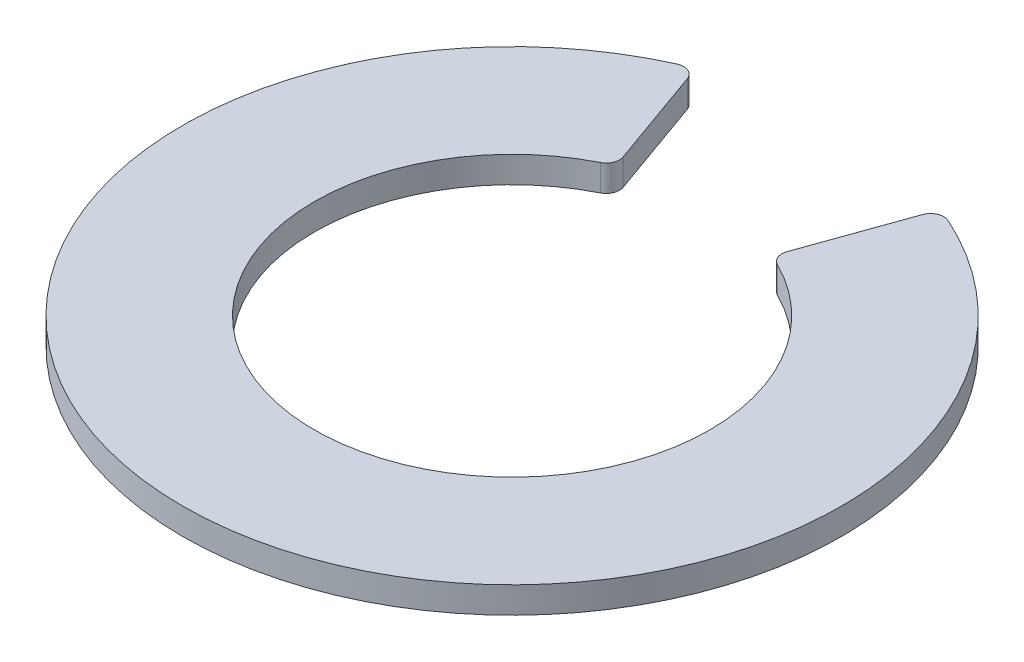
ISO-10303-21;
HEADER;
FILE_DESCRIPTION(('STEP AP214'),'2;1');
FILE_NAME('part.step','',(''),(''),'','','');
FILE_SCHEMA(('AUTOMOTIVE_DESIGN { 1 0 10303 214 1 1 1 1 }'));
ENDSEC;
DATA;
#1=APPLICATION_CONTEXT('core data for automotive mechanical design processes');
#2=APPLICATION_PROTOCOL_DEFINITION('international standard','automotive_design',2000,#1);
#3=PRODUCT_CONTEXT('',#1,'mechanical');
#4=PRODUCT('Part','Part','',(#3));
#5=PRODUCT_RELATED_PRODUCT_CATEGORY('part','',(#4));
#6=PRODUCT_DEFINITION_FORMATION('','',#4);
#7=PRODUCT_DEFINITION_CONTEXT('part definition',#1,'design');
#8=PRODUCT_DEFINITION('design','',#6,#7);
#9=PRODUCT_DEFINITION_SHAPE('','',#8);
#10=(LENGTH_UNIT() NAMED_UNIT(*) SI_UNIT(.MILLI.,.METRE.));
#11=(NAMED_UNIT(*) PLANE_ANGLE_UNIT() SI_UNIT($,.RADIAN.));
#12=(NAMED_UNIT(*) SI_UNIT($,.STERADIAN.) SOLID_ANGLE_UNIT());
#13=UNCERTAINTY_MEASURE_WITH_UNIT(LENGTH_MEASURE(1.E-05),#10,'distance_accuracy_value','');
#14=(GEOMETRIC_REPRESENTATION_CONTEXT(3) GLOBAL_UNCERTAINTY_ASSIGNED_CONTEXT((#13)) GLOBAL_UNIT_ASSIGNED_CONTEXT((#10,
#11,#12)) REPRESENTATION_CONTEXT('',''));
#15=CARTESIAN_POINT('',(0.,0.,0.));
#16=DIRECTION('',(0.,0.,1.));
#17=DIRECTION('',(1.,0.,0.));
#18=AXIS2_PLACEMENT_3D('',#15,#16,#17);
#19=CARTESIAN_POINT('',(0.716215773117181,0.2,-1.43074629698565));
#20=DIRECTION('',(0.,-1.,0.));
#21=DIRECTION('',(0.,0.,-1.));
#22=AXIS2_PLACEMENT_3D('',#19,#20,#21);
#23=CYLINDRICAL_SURFACE('',#22,0.1);
#24=CARTESIAN_POINT('',(0.716215773117181,0.,-1.43074629698565));
#25=DIRECTION('',(0.,1.,0.));
#26=DIRECTION('',(0.,0.,-1.));
#27=AXIS2_PLACEMENT_3D('',#24,#25,#26);
#28=CIRCLE('',#27,0.1);
#29=CARTESIAN_POINT('',(0.622035989596102,0.,-1.46436427396112));
#30=VERTEX_POINT('',#29);
#31=CARTESIAN_POINT('',(0.671452287297356,0.,-1.34132465342405));
#32=VERTEX_POINT('',#31);
#33=EDGE_CURVE('E142',#30,#32,#28,.T.);
#34=ORIENTED_EDGE('',*,*,#33,.T.);
#35=DIRECTION('',(0.,-1.,0.));
#36=VECTOR('',#35,1.);
#37=CARTESIAN_POINT('',(0.671452287297356,0.2,-1.34132465342405));
#38=LINE('',#37,#36);
#39=CARTESIAN_POINT('',(0.671452287297356,0.2,-1.34132465342405));
#40=VERTEX_POINT('',#39);
#41=EDGE_CURVE('E11',#40,#32,#38,.T.);
#42=ORIENTED_EDGE('',*,*,#41,.F.);
#43=CARTESIAN_POINT('',(0.716215773117181,0.2,-1.43074629698565));
#44=DIRECTION('',(0.,1.,0.));
#45=DIRECTION('',(0.,0.,-1.));
#46=AXIS2_PLACEMENT_3D('',#43,#44,#45);
#47=CIRCLE('',#46,0.1);
#48=CARTESIAN_POINT('',(0.622035989596102,0.2,-1.46436427396112));
#49=VERTEX_POINT('',#48);
#50=EDGE_CURVE('E164',#49,#40,#47,.T.);
#51=ORIENTED_EDGE('',*,*,#50,.F.);
#52=DIRECTION('',(0.,-1.,0.));
#53=VECTOR('',#52,1.);
#54=CARTESIAN_POINT('',(0.622035989596102,0.2,-1.46436427396112));
#55=LINE('',#54,#53);
#56=EDGE_CURVE('E138',#49,#30,#55,.T.);
#57=ORIENTED_EDGE('',*,*,#56,.T.);
#58=EDGE_LOOP('',(#34,#42,#51,#57));
#59=FACE_BOUND('',#58,.T.);
#60=ADVANCED_FACE('F41',(#59),#23,.T.);
#61=CARTESIAN_POINT('',(0.,0.2,0.));
#62=DIRECTION('',(0.,-1.,0.));
#63=DIRECTION('',(0.,0.,-1.));
#64=AXIS2_PLACEMENT_3D('',#61,#62,#63);
#65=CYLINDRICAL_SURFACE('',#64,1.5);
#66=CARTESIAN_POINT('',(0.,0.,0.));
#67=DIRECTION('',(0.,-1.,0.));
#68=DIRECTION('',(0.,0.,1.));
#69=AXIS2_PLACEMENT_3D('',#66,#67,#68);
#70=CIRCLE('',#69,1.5);
#71=CARTESIAN_POINT('',(-0.671452287297357,0.,-1.34132465342405));
#72=VERTEX_POINT('',#71);
#73=EDGE_CURVE('E146',#32,#72,#70,.T.);
#74=ORIENTED_EDGE('',*,*,#73,.T.);
#75=DIRECTION('',(0.,-1.,0.));
#76=VECTOR('',#75,1.);
#77=CARTESIAN_POINT('',(-0.671452287297357,0.2,-1.34132465342405));
#78=LINE('',#77,#76);
#79=CARTESIAN_POINT('',(-0.671452287297357,0.2,-1.34132465342405));
#80=VERTEX_POINT('',#79);
#81=EDGE_CURVE('E50',#80,#72,#78,.T.);
#82=ORIENTED_EDGE('',*,*,#81,.F.);
#83=CARTESIAN_POINT('',(0.,0.2,0.));
#84=DIRECTION('',(0.,-1.,0.));
#85=DIRECTION('',(0.,0.,1.));
#86=AXIS2_PLACEMENT_3D('',#83,#84,#85);
#87=CIRCLE('',#86,1.5);
#88=EDGE_CURVE('E101',#40,#80,#87,.T.);
#89=ORIENTED_EDGE('',*,*,#88,.F.);
#90=ORIENTED_EDGE('',*,*,#41,.T.);
#91=EDGE_LOOP('',(#74,#82,#89,#90));
#92=FACE_BOUND('',#91,.T.);
#93=ADVANCED_FACE('F210',(#92),#65,.F.);
#94=CARTESIAN_POINT('',(-0.716215773117181,0.2,-1.43074629698565));
#95=DIRECTION('',(0.,-1.,0.));
#96=DIRECTION('',(0.,0.,-1.));
#97=AXIS2_PLACEMENT_3D('',#94,#95,#96);
#98=CYLINDRICAL_SURFACE('',#97,0.0999999999999998);
#99=CARTESIAN_POINT('',(-0.716215773117181,0.,-1.43074629698565));
#100=DIRECTION('',(0.,1.,0.));
#101=DIRECTION('',(0.,0.,1.));
#102=AXIS2_PLACEMENT_3D('',#99,#100,#101);
#103=CIRCLE('',#102,0.0999999999999998);
#104=CARTESIAN_POINT('',(-0.622035989596102,0.,-1.46436427396112));
#105=VERTEX_POINT('',#104);
#106=EDGE_CURVE('E149',#72,#105,#103,.T.);
#107=ORIENTED_EDGE('',*,*,#106,.T.);
#108=DIRECTION('',(0.,-1.,0.));
#109=VECTOR('',#108,1.);
#110=CARTESIAN_POINT('',(-0.622035989596102,0.2,-1.46436427396112));
#111=LINE('',#110,#109);
#112=CARTESIAN_POINT('',(-0.622035989596102,0.2,-1.46436427396112));
#113=VERTEX_POINT('',#112);
#114=EDGE_CURVE('E175',#113,#105,#111,.T.);
#115=ORIENTED_EDGE('',*,*,#114,.F.);
#116=CARTESIAN_POINT('',(-0.716215773117181,0.2,-1.43074629698565));
#117=DIRECTION('',(0.,1.,0.));
#118=DIRECTION('',(0.,0.,1.));
#119=AXIS2_PLACEMENT_3D('',#116,#117,#118);
#120=CIRCLE('',#119,0.0999999999999998);
#121=EDGE_CURVE('E185',#80,#113,#120,.T.);
#122=ORIENTED_EDGE('',*,*,#121,.F.);
#123=ORIENTED_EDGE('',*,*,#81,.T.);
#124=EDGE_LOOP('',(#107,#115,#122,#123));
#125=FACE_BOUND('',#124,.T.);
#126=ADVANCED_FACE('F183',(#125),#98,.T.);
#127=CARTESIAN_POINT('',(-0.892301783922357,0.2,-2.2215060264639));
#128=DIRECTION('',(-0.941797835210792,0.,0.336179769754614));
#129=DIRECTION('',(0.336179769754614,0.,0.941797835210792));
#130=AXIS2_PLACEMENT_3D('',#127,#128,#129);
#131=PLANE('',#130);
#132=DIRECTION('',(-0.336179769754614,0.,-0.941797835210792));
#133=VECTOR('',#132,1.);
#134=CARTESIAN_POINT('',(-0.892301783922357,0.,-2.2215060264639));
#135=LINE('',#134,#133);
#136=CARTESIAN_POINT('',(-0.892301783922357,0.,-2.2215060264639));
#137=VERTEX_POINT('',#136);
#138=EDGE_CURVE('E152',#105,#137,#135,.T.);
#139=ORIENTED_EDGE('',*,*,#138,.T.);
#140=DIRECTION('',(0.,-1.,0.));
#141=VECTOR('',#140,1.);
#142=CARTESIAN_POINT('',(-0.892301783922357,0.2,-2.2215060264639));
#143=LINE('',#142,#141);
#144=CARTESIAN_POINT('',(-0.892301783922357,0.2,-2.2215060264639));
#145=VERTEX_POINT('',#144);
#146=EDGE_CURVE('E171',#145,#137,#143,.T.);
#147=ORIENTED_EDGE('',*,*,#146,.F.);
#148=DIRECTION('',(-0.336179769754614,0.,-0.941797835210792));
#149=VECTOR('',#148,1.);
#150=CARTESIAN_POINT('',(-0.892301783922357,0.2,-2.2215060264639));
#151=LINE('',#150,#149);
#152=EDGE_CURVE('E198',#113,#145,#151,.T.);
#153=ORIENTED_EDGE('',*,*,#152,.F.);
#154=ORIENTED_EDGE('',*,*,#114,.T.);
#155=EDGE_LOOP('',(#139,#147,#153,#154));
#156=FACE_BOUND('',#155,.T.);
#157=ADVANCED_FACE('F193',(#156),#131,.F.);
#158=CARTESIAN_POINT('',(-0.986481567443436,0.2,-2.18788804948844));
#159=DIRECTION('',(0.,-1.,0.));
#160=DIRECTION('',(0.,0.,-1.));
#161=AXIS2_PLACEMENT_3D('',#158,#159,#160);
#162=CYLINDRICAL_SURFACE('',#161,0.0999999999999999);
#163=CARTESIAN_POINT('',(-0.986481567443436,0.,-2.18788804948844));
#164=DIRECTION('',(0.,1.,0.));
#165=DIRECTION('',(0.,0.,-1.));
#166=AXIS2_PLACEMENT_3D('',#163,#164,#165);
#167=CIRCLE('',#166,0.0999999999999999);
#168=CARTESIAN_POINT('',(-1.02758496608691,0.,-2.27905005155046));
#169=VERTEX_POINT('',#168);
#170=EDGE_CURVE('E155',#137,#169,#167,.T.);
#171=ORIENTED_EDGE('',*,*,#170,.T.);
#172=DIRECTION('',(0.,-1.,0.));
#173=VECTOR('',#172,1.);
#174=CARTESIAN_POINT('',(-1.02758496608691,0.2,-2.27905005155046));
#175=LINE('',#174,#173);
#176=CARTESIAN_POINT('',(-1.02758496608691,0.2,-2.27905005155046));
#177=VERTEX_POINT('',#176);
#178=EDGE_CURVE('E131',#177,#169,#175,.T.);
#179=ORIENTED_EDGE('',*,*,#178,.F.);
#180=CARTESIAN_POINT('',(-0.986481567443436,0.2,-2.18788804948844));
#181=DIRECTION('',(0.,1.,0.));
#182=DIRECTION('',(0.,0.,-1.));
#183=AXIS2_PLACEMENT_3D('',#180,#181,#182);
#184=CIRCLE('',#183,0.0999999999999999);
#185=EDGE_CURVE('E120',#145,#177,#184,.T.);
#186=ORIENTED_EDGE('',*,*,#185,.F.);
#187=ORIENTED_EDGE('',*,*,#146,.T.);
#188=EDGE_LOOP('',(#171,#179,#186,#187));
#189=FACE_BOUND('',#188,.T.);
#190=ADVANCED_FACE('F196',(#189),#162,.T.);
#191=CARTESIAN_POINT('',(0.,0.2,0.));
#192=DIRECTION('',(0.,-1.,0.));
#193=DIRECTION('',(0.,0.,-1.));
#194=AXIS2_PLACEMENT_3D('',#191,#192,#193);
#195=CYLINDRICAL_SURFACE('',#194,2.5);
#196=CARTESIAN_POINT('',(0.,0.,0.));
#197=DIRECTION('',(0.,1.,0.));
#198=DIRECTION('',(0.,0.,1.));
#199=AXIS2_PLACEMENT_3D('',#196,#197,#198);
#200=CIRCLE('',#199,2.5);
#201=CARTESIAN_POINT('',(1.02758496608691,0.,-2.27905005155046));
#202=VERTEX_POINT('',#201);
#203=EDGE_CURVE('E129',#169,#202,#200,.T.);
#204=ORIENTED_EDGE('',*,*,#203,.T.);
#205=DIRECTION('',(0.,-1.,0.));
#206=VECTOR('',#205,1.);
#207=CARTESIAN_POINT('',(1.02758496608691,0.2,-2.27905005155046));
#208=LINE('',#207,#206);
#209=CARTESIAN_POINT('',(1.02758496608691,0.2,-2.27905005155046));
#210=VERTEX_POINT('',#209);
#211=EDGE_CURVE('E126',#210,#202,#208,.T.);
#212=ORIENTED_EDGE('',*,*,#211,.F.);
#213=CARTESIAN_POINT('',(0.,0.2,0.));
#214=DIRECTION('',(0.,1.,0.));
#215=DIRECTION('',(0.,0.,1.));
#216=AXIS2_PLACEMENT_3D('',#213,#214,#215);
#217=CIRCLE('',#216,2.5);
#218=EDGE_CURVE('E114',#177,#210,#217,.T.);
#219=ORIENTED_EDGE('',*,*,#218,.F.);
#220=ORIENTED_EDGE('',*,*,#178,.T.);
#221=EDGE_LOOP('',(#204,#212,#219,#220));
#222=FACE_BOUND('',#221,.T.);
#223=ADVANCED_FACE('F127',(#222),#195,.T.);
#224=CARTESIAN_POINT('',(0.986481567443436,0.2,-2.18788804948844));
#225=DIRECTION('',(0.,-1.,0.));
#226=DIRECTION('',(0.,0.,-1.));
#227=AXIS2_PLACEMENT_3D('',#224,#225,#226);
#228=CYLINDRICAL_SURFACE('',#227,0.0999999999999999);
#229=CARTESIAN_POINT('',(0.986481567443436,0.,-2.18788804948844));
#230=DIRECTION('',(0.,1.,0.));
#231=DIRECTION('',(0.,0.,1.));
#232=AXIS2_PLACEMENT_3D('',#229,#230,#231);
#233=CIRCLE('',#232,0.0999999999999999);
#234=CARTESIAN_POINT('',(0.892301783922357,0.,-2.2215060264639));
#235=VERTEX_POINT('',#234);
#236=EDGE_CURVE('E87',#202,#235,#233,.T.);
#237=ORIENTED_EDGE('',*,*,#236,.T.);
#238=DIRECTION('',(0.,-1.,0.));
#239=VECTOR('',#238,1.);
#240=CARTESIAN_POINT('',(0.892301783922357,0.2,-2.2215060264639));
#241=LINE('',#240,#239);
#242=CARTESIAN_POINT('',(0.892301783922357,0.2,-2.2215060264639));
#243=VERTEX_POINT('',#242);
#244=EDGE_CURVE('E132',#243,#235,#241,.T.);
#245=ORIENTED_EDGE('',*,*,#244,.F.);
#246=CARTESIAN_POINT('',(0.986481567443436,0.2,-2.18788804948844));
#247=DIRECTION('',(0.,1.,0.));
#248=DIRECTION('',(0.,0.,1.));
#249=AXIS2_PLACEMENT_3D('',#246,#247,#248);
#250=CIRCLE('',#249,0.0999999999999999);
#251=EDGE_CURVE('E118',#210,#243,#250,.T.);
#252=ORIENTED_EDGE('',*,*,#251,.F.);
#253=ORIENTED_EDGE('',*,*,#211,.T.);
#254=EDGE_LOOP('',(#237,#245,#252,#253));
#255=FACE_BOUND('',#254,.T.);
#256=ADVANCED_FACE('F134',(#255),#228,.T.);
#257=CARTESIAN_POINT('',(0.892301783922357,0.2,-2.2215060264639));
#258=DIRECTION('',(0.941797835210792,0.,0.336179769754614));
#259=DIRECTION('',(0.336179769754614,0.,-0.941797835210792));
#260=AXIS2_PLACEMENT_3D('',#257,#258,#259);
#261=PLANE('',#260);
#262=DIRECTION('',(-0.336179769754614,0.,0.941797835210792));
#263=VECTOR('',#262,1.);
#264=CARTESIAN_POINT('',(0.892301783922357,0.,-2.2215060264639));
#265=LINE('',#264,#263);
#266=EDGE_CURVE('E93',#235,#30,#265,.T.);
#267=ORIENTED_EDGE('',*,*,#266,.T.);
#268=ORIENTED_EDGE('',*,*,#56,.F.);
#269=DIRECTION('',(-0.336179769754614,0.,0.941797835210792));
#270=VECTOR('',#269,1.);
#271=CARTESIAN_POINT('',(0.892301783922357,0.2,-2.2215060264639));
#272=LINE('',#271,#270);
#273=EDGE_CURVE('E58',#243,#49,#272,.T.);
#274=ORIENTED_EDGE('',*,*,#273,.F.);
#275=ORIENTED_EDGE('',*,*,#244,.T.);
#276=EDGE_LOOP('',(#267,#268,#274,#275));
#277=FACE_BOUND('',#276,.T.);
#278=ADVANCED_FACE('F226',(#277),#261,.F.);
#279=CARTESIAN_POINT('',(0.716215773117181,0.2,-1.43074629698565));
#280=DIRECTION('',(0.,-1.,0.));
#281=DIRECTION('',(0.,0.,-1.));
#282=AXIS2_PLACEMENT_3D('',#279,#280,#281);
#283=PLANE('',#282);
#284=ORIENTED_EDGE('',*,*,#50,.T.);
#285=ORIENTED_EDGE('',*,*,#88,.T.);
#286=ORIENTED_EDGE('',*,*,#121,.T.);
#287=ORIENTED_EDGE('',*,*,#152,.T.);
#288=ORIENTED_EDGE('',*,*,#185,.T.);
#289=ORIENTED_EDGE('',*,*,#218,.T.);
#290=ORIENTED_EDGE('',*,*,#251,.T.);
#291=ORIENTED_EDGE('',*,*,#273,.T.);
#292=EDGE_LOOP('',(#284,#285,#286,#287,#288,#289,#290,#291));
#293=FACE_BOUND('',#292,.T.);
#294=ADVANCED_FACE('F116',(#293),#283,.F.);
#295=CARTESIAN_POINT('',(0.716215773117181,0.,-1.43074629698565));
#296=DIRECTION('',(0.,-1.,0.));
#297=DIRECTION('',(0.,0.,-1.));
#298=AXIS2_PLACEMENT_3D('',#295,#296,#297);
#299=PLANE('',#298);
#300=ORIENTED_EDGE('',*,*,#33,.F.);
#301=ORIENTED_EDGE('',*,*,#266,.F.);
#302=ORIENTED_EDGE('',*,*,#236,.F.);
#303=ORIENTED_EDGE('',*,*,#203,.F.);
#304=ORIENTED_EDGE('',*,*,#170,.F.);
#305=ORIENTED_EDGE('',*,*,#138,.F.);
#306=ORIENTED_EDGE('',*,*,#106,.F.);
#307=ORIENTED_EDGE('',*,*,#73,.F.);
#308=EDGE_LOOP('',(#300,#301,#302,#303,#304,#305,#306,#307));
#309=FACE_BOUND('',#308,.T.);
#310=ADVANCED_FACE('F189',(#309),#299,.T.);
#311=CLOSED_SHELL('',(#60,#93,#126,#157,#190,#223,#256,#278,#294,#310));
#312=MANIFOLD_SOLID_BREP('B2',#311);
#313=ADVANCED_BREP_SHAPE_REPRESENTATION('',(#18,#312),#14);
#314=SHAPE_DEFINITION_REPRESENTATION(#9,#313);
ENDSEC;
END-ISO-10303-21;
